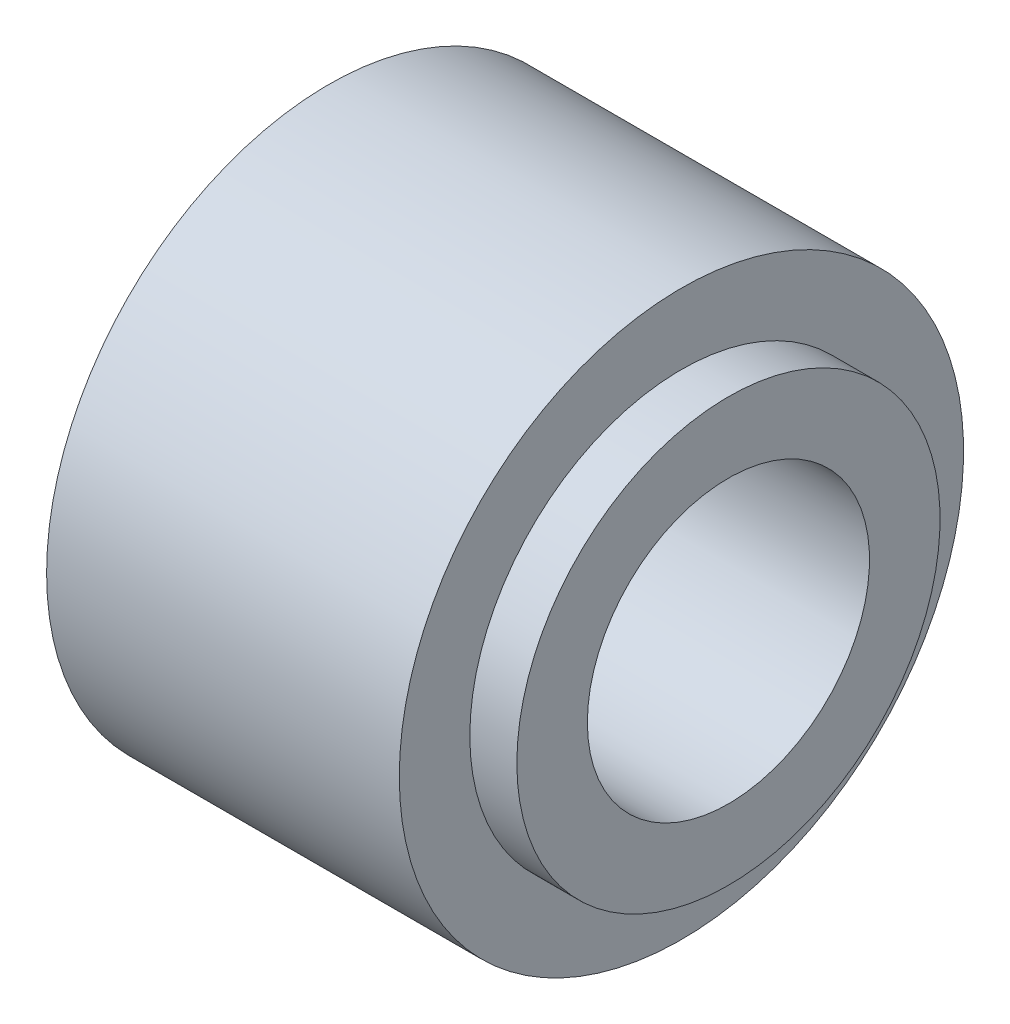
ISO-10303-21;
HEADER;
FILE_DESCRIPTION(('STEP AP214'),'2;1');
FILE_NAME('part.step','',(''),(''),'','','');
FILE_SCHEMA(('AUTOMOTIVE_DESIGN { 1 0 10303 214 1 1 1 1 }'));
ENDSEC;
DATA;
#1=APPLICATION_CONTEXT('core data for automotive mechanical design processes');
#2=APPLICATION_PROTOCOL_DEFINITION('international standard','automotive_design',2000,#1);
#3=PRODUCT_CONTEXT('',#1,'mechanical');
#4=PRODUCT('Part','Part','',(#3));
#5=PRODUCT_RELATED_PRODUCT_CATEGORY('part','',(#4));
#6=PRODUCT_DEFINITION_FORMATION('','',#4);
#7=PRODUCT_DEFINITION_CONTEXT('part definition',#1,'design');
#8=PRODUCT_DEFINITION('design','',#6,#7);
#9=PRODUCT_DEFINITION_SHAPE('','',#8);
#10=(LENGTH_UNIT() NAMED_UNIT(*) SI_UNIT(.MILLI.,.METRE.));
#11=(NAMED_UNIT(*) PLANE_ANGLE_UNIT() SI_UNIT($,.RADIAN.));
#12=(NAMED_UNIT(*) SI_UNIT($,.STERADIAN.) SOLID_ANGLE_UNIT());
#13=UNCERTAINTY_MEASURE_WITH_UNIT(LENGTH_MEASURE(1.E-05),#10,'distance_accuracy_value','');
#14=(GEOMETRIC_REPRESENTATION_CONTEXT(3) GLOBAL_UNCERTAINTY_ASSIGNED_CONTEXT((#13)) GLOBAL_UNIT_ASSIGNED_CONTEXT((#10,
#11,#12)) REPRESENTATION_CONTEXT('',''));
#15=CARTESIAN_POINT('',(0.,0.,0.));
#16=DIRECTION('',(0.,0.,1.));
#17=DIRECTION('',(1.,0.,0.));
#18=AXIS2_PLACEMENT_3D('',#15,#16,#17);
#19=CARTESIAN_POINT('',(0.,0.,0.));
#20=DIRECTION('',(-1.,0.,0.));
#21=DIRECTION('',(0.,0.,1.));
#22=AXIS2_PLACEMENT_3D('',#19,#20,#21);
#23=CYLINDRICAL_SURFACE('',#22,6.);
#24=CARTESIAN_POINT('',(0.,0.,0.));
#25=DIRECTION('',(-1.,0.,0.));
#26=DIRECTION('',(0.,0.,1.));
#27=AXIS2_PLACEMENT_3D('',#24,#25,#26);
#28=CIRCLE('',#27,6.);
#29=CARTESIAN_POINT('',(0.,0.,6.));
#30=VERTEX_POINT('',#29);
#31=EDGE_CURVE('E10',#30,#30,#28,.T.);
#32=ORIENTED_EDGE('',*,*,#31,.F.);
#33=EDGE_LOOP('',(#32));
#34=FACE_BOUND('',#33,.T.);
#35=CARTESIAN_POINT('',(7.5,0.,0.));
#36=DIRECTION('',(-1.,0.,0.));
#37=DIRECTION('',(0.,0.,1.));
#38=AXIS2_PLACEMENT_3D('',#35,#36,#37);
#39=CIRCLE('',#38,6.);
#40=CARTESIAN_POINT('',(7.5,0.,6.));
#41=VERTEX_POINT('',#40);
#42=EDGE_CURVE('E51',#41,#41,#39,.T.);
#43=ORIENTED_EDGE('',*,*,#42,.T.);
#44=EDGE_LOOP('',(#43));
#45=FACE_BOUND('',#44,.T.);
#46=ADVANCED_FACE('F29',(#34,#45),#23,.T.);
#47=CARTESIAN_POINT('',(0.,6.,0.));
#48=DIRECTION('',(1.,0.,0.));
#49=DIRECTION('',(0.,0.,-1.));
#50=AXIS2_PLACEMENT_3D('',#47,#48,#49);
#51=PLANE('',#50);
#52=CARTESIAN_POINT('',(0.,0.,0.));
#53=DIRECTION('',(-1.,0.,0.));
#54=DIRECTION('',(0.,0.,1.));
#55=AXIS2_PLACEMENT_3D('',#52,#53,#54);
#56=CIRCLE('',#55,3.);
#57=CARTESIAN_POINT('',(0.,0.,3.));
#58=VERTEX_POINT('',#57);
#59=EDGE_CURVE('E35',#58,#58,#56,.T.);
#60=ORIENTED_EDGE('',*,*,#59,.F.);
#61=EDGE_LOOP('',(#60));
#62=FACE_BOUND('',#61,.T.);
#63=ORIENTED_EDGE('',*,*,#31,.T.);
#64=EDGE_LOOP('',(#63));
#65=FACE_BOUND('',#64,.T.);
#66=ADVANCED_FACE('F76',(#62,#65),#51,.F.);
#67=CARTESIAN_POINT('',(0.,0.,0.));
#68=DIRECTION('',(-1.,0.,0.));
#69=DIRECTION('',(0.,0.,1.));
#70=AXIS2_PLACEMENT_3D('',#67,#68,#69);
#71=CYLINDRICAL_SURFACE('',#70,3.);
#72=CARTESIAN_POINT('',(8.5,0.,0.));
#73=DIRECTION('',(-1.,0.,0.));
#74=DIRECTION('',(0.,0.,1.));
#75=AXIS2_PLACEMENT_3D('',#72,#73,#74);
#76=CIRCLE('',#75,3.);
#77=CARTESIAN_POINT('',(8.5,0.,3.));
#78=VERTEX_POINT('',#77);
#79=EDGE_CURVE('E39',#78,#78,#76,.T.);
#80=ORIENTED_EDGE('',*,*,#79,.F.);
#81=EDGE_LOOP('',(#80));
#82=FACE_BOUND('',#81,.T.);
#83=ORIENTED_EDGE('',*,*,#59,.T.);
#84=EDGE_LOOP('',(#83));
#85=FACE_BOUND('',#84,.T.);
#86=ADVANCED_FACE('F71',(#82,#85),#71,.F.);
#87=CARTESIAN_POINT('',(8.5,3.,0.));
#88=DIRECTION('',(-1.,0.,0.));
#89=DIRECTION('',(0.,0.,1.));
#90=AXIS2_PLACEMENT_3D('',#87,#88,#89);
#91=PLANE('',#90);
#92=CARTESIAN_POINT('',(8.5,0.,0.));
#93=DIRECTION('',(-1.,0.,0.));
#94=DIRECTION('',(0.,0.,1.));
#95=AXIS2_PLACEMENT_3D('',#92,#93,#94);
#96=CIRCLE('',#95,4.5);
#97=CARTESIAN_POINT('',(8.5,0.,4.5));
#98=VERTEX_POINT('',#97);
#99=EDGE_CURVE('E43',#98,#98,#96,.T.);
#100=ORIENTED_EDGE('',*,*,#99,.F.);
#101=EDGE_LOOP('',(#100));
#102=FACE_BOUND('',#101,.T.);
#103=ORIENTED_EDGE('',*,*,#79,.T.);
#104=EDGE_LOOP('',(#103));
#105=FACE_BOUND('',#104,.T.);
#106=ADVANCED_FACE('F65',(#102,#105),#91,.F.);
#107=CARTESIAN_POINT('',(0.,0.,0.));
#108=DIRECTION('',(-1.,0.,0.));
#109=DIRECTION('',(0.,0.,1.));
#110=AXIS2_PLACEMENT_3D('',#107,#108,#109);
#111=CYLINDRICAL_SURFACE('',#110,4.5);
#112=CARTESIAN_POINT('',(7.5,0.,0.));
#113=DIRECTION('',(-1.,0.,0.));
#114=DIRECTION('',(0.,0.,1.));
#115=AXIS2_PLACEMENT_3D('',#112,#113,#114);
#116=CIRCLE('',#115,4.5);
#117=CARTESIAN_POINT('',(7.5,0.,4.5));
#118=VERTEX_POINT('',#117);
#119=EDGE_CURVE('E48',#118,#118,#116,.T.);
#120=ORIENTED_EDGE('',*,*,#119,.F.);
#121=EDGE_LOOP('',(#120));
#122=FACE_BOUND('',#121,.T.);
#123=ORIENTED_EDGE('',*,*,#99,.T.);
#124=EDGE_LOOP('',(#123));
#125=FACE_BOUND('',#124,.T.);
#126=ADVANCED_FACE('F59',(#122,#125),#111,.T.);
#127=CARTESIAN_POINT('',(7.5,4.5,0.));
#128=DIRECTION('',(-1.,0.,0.));
#129=DIRECTION('',(0.,0.,1.));
#130=AXIS2_PLACEMENT_3D('',#127,#128,#129);
#131=PLANE('',#130);
#132=ORIENTED_EDGE('',*,*,#42,.F.);
#133=EDGE_LOOP('',(#132));
#134=FACE_BOUND('',#133,.T.);
#135=ORIENTED_EDGE('',*,*,#119,.T.);
#136=EDGE_LOOP('',(#135));
#137=FACE_BOUND('',#136,.T.);
#138=ADVANCED_FACE('F56',(#134,#137),#131,.F.);
#139=CLOSED_SHELL('',(#46,#66,#86,#106,#126,#138));
#140=MANIFOLD_SOLID_BREP('B2',#139);
#141=ADVANCED_BREP_SHAPE_REPRESENTATION('',(#18,#140),#14);
#142=SHAPE_DEFINITION_REPRESENTATION(#9,#141);
ENDSEC;
END-ISO-10303-21;
